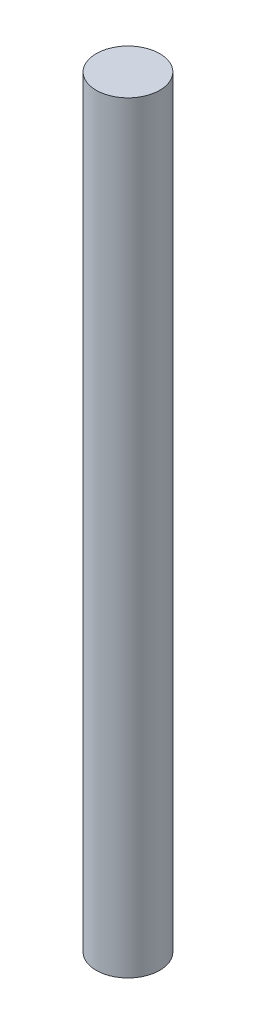
ISO-10303-21;
HEADER;
FILE_DESCRIPTION(('STEP AP214'),'2;1');
FILE_NAME('part.step','',(''),(''),'','','');
FILE_SCHEMA(('AUTOMOTIVE_DESIGN { 1 0 10303 214 1 1 1 1 }'));
ENDSEC;
DATA;
#1=APPLICATION_CONTEXT('core data for automotive mechanical design processes');
#2=APPLICATION_PROTOCOL_DEFINITION('international standard','automotive_design',2000,#1);
#3=PRODUCT_CONTEXT('',#1,'mechanical');
#4=PRODUCT('Part','Part','',(#3));
#5=PRODUCT_RELATED_PRODUCT_CATEGORY('part','',(#4));
#6=PRODUCT_DEFINITION_FORMATION('','',#4);
#7=PRODUCT_DEFINITION_CONTEXT('part definition',#1,'design');
#8=PRODUCT_DEFINITION('design','',#6,#7);
#9=PRODUCT_DEFINITION_SHAPE('','',#8);
#10=(LENGTH_UNIT() NAMED_UNIT(*) SI_UNIT(.MILLI.,.METRE.));
#11=(NAMED_UNIT(*) PLANE_ANGLE_UNIT() SI_UNIT($,.RADIAN.));
#12=(NAMED_UNIT(*) SI_UNIT($,.STERADIAN.) SOLID_ANGLE_UNIT());
#13=UNCERTAINTY_MEASURE_WITH_UNIT(LENGTH_MEASURE(1.E-05),#10,'distance_accuracy_value','');
#14=(GEOMETRIC_REPRESENTATION_CONTEXT(3) GLOBAL_UNCERTAINTY_ASSIGNED_CONTEXT((#13)) GLOBAL_UNIT_ASSIGNED_CONTEXT((#10,
#11,#12)) REPRESENTATION_CONTEXT('',''));
#15=CARTESIAN_POINT('',(0.,0.,0.));
#16=DIRECTION('',(0.,0.,1.));
#17=DIRECTION('',(1.,0.,0.));
#18=AXIS2_PLACEMENT_3D('',#15,#16,#17);
#19=CARTESIAN_POINT('',(0.,152.4,0.));
#20=DIRECTION('',(0.,-1.,0.));
#21=DIRECTION('',(0.,0.,-1.));
#22=AXIS2_PLACEMENT_3D('',#19,#20,#21);
#23=CYLINDRICAL_SURFACE('',#22,6.35);
#24=CARTESIAN_POINT('',(0.,152.4,0.));
#25=DIRECTION('',(0.,1.,0.));
#26=DIRECTION('',(0.,0.,1.));
#27=AXIS2_PLACEMENT_3D('',#24,#25,#26);
#28=CIRCLE('',#27,6.35);
#29=CARTESIAN_POINT('',(0.,152.4,6.35));
#30=VERTEX_POINT('',#29);
#31=EDGE_CURVE('E10',#30,#30,#28,.T.);
#32=ORIENTED_EDGE('',*,*,#31,.F.);
#33=EDGE_LOOP('',(#32));
#34=FACE_BOUND('',#33,.T.);
#35=CARTESIAN_POINT('',(0.,0.,0.));
#36=DIRECTION('',(0.,1.,0.));
#37=DIRECTION('',(0.,0.,1.));
#38=AXIS2_PLACEMENT_3D('',#35,#36,#37);
#39=CIRCLE('',#38,6.35);
#40=CARTESIAN_POINT('',(0.,0.,6.35));
#41=VERTEX_POINT('',#40);
#42=EDGE_CURVE('E34',#41,#41,#39,.T.);
#43=ORIENTED_EDGE('',*,*,#42,.T.);
#44=EDGE_LOOP('',(#43));
#45=FACE_BOUND('',#44,.T.);
#46=ADVANCED_FACE('F31',(#34,#45),#23,.T.);
#47=CARTESIAN_POINT('',(0.,152.4,0.));
#48=DIRECTION('',(0.,1.,0.));
#49=DIRECTION('',(0.,0.,1.));
#50=AXIS2_PLACEMENT_3D('',#47,#48,#49);
#51=PLANE('',#50);
#52=ORIENTED_EDGE('',*,*,#31,.T.);
#53=EDGE_LOOP('',(#52));
#54=FACE_BOUND('',#53,.T.);
#55=ADVANCED_FACE('F46',(#54),#51,.T.);
#56=CARTESIAN_POINT('',(0.,0.,0.));
#57=DIRECTION('',(0.,1.,0.));
#58=DIRECTION('',(0.,0.,1.));
#59=AXIS2_PLACEMENT_3D('',#56,#57,#58);
#60=PLANE('',#59);
#61=ORIENTED_EDGE('',*,*,#42,.F.);
#62=EDGE_LOOP('',(#61));
#63=FACE_BOUND('',#62,.T.);
#64=ADVANCED_FACE('F44',(#63),#60,.F.);
#65=CLOSED_SHELL('',(#46,#55,#64));
#66=MANIFOLD_SOLID_BREP('B2',#65);
#67=ADVANCED_BREP_SHAPE_REPRESENTATION('',(#18,#66),#14);
#68=SHAPE_DEFINITION_REPRESENTATION(#9,#67);
ENDSEC;
END-ISO-10303-21;
